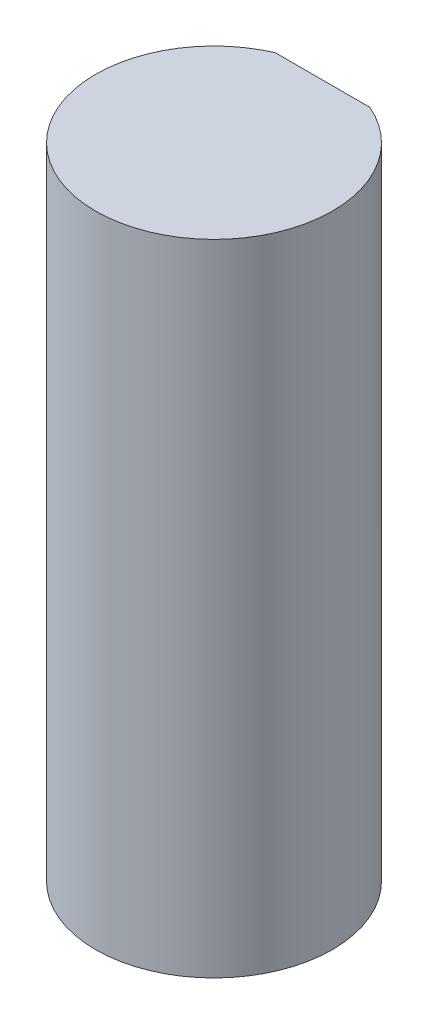
ISO-10303-21;
HEADER;
FILE_DESCRIPTION(('STEP AP214'),'2;1');
FILE_NAME('part.step','',(''),(''),'','','');
FILE_SCHEMA(('AUTOMOTIVE_DESIGN { 1 0 10303 214 1 1 1 1 }'));
ENDSEC;
DATA;
#1=APPLICATION_CONTEXT('core data for automotive mechanical design processes');
#2=APPLICATION_PROTOCOL_DEFINITION('international standard','automotive_design',2000,#1);
#3=PRODUCT_CONTEXT('',#1,'mechanical');
#4=PRODUCT('Part','Part','',(#3));
#5=PRODUCT_RELATED_PRODUCT_CATEGORY('part','',(#4));
#6=PRODUCT_DEFINITION_FORMATION('','',#4);
#7=PRODUCT_DEFINITION_CONTEXT('part definition',#1,'design');
#8=PRODUCT_DEFINITION('design','',#6,#7);
#9=PRODUCT_DEFINITION_SHAPE('','',#8);
#10=(LENGTH_UNIT() NAMED_UNIT(*) SI_UNIT(.MILLI.,.METRE.));
#11=(NAMED_UNIT(*) PLANE_ANGLE_UNIT() SI_UNIT($,.RADIAN.));
#12=(NAMED_UNIT(*) SI_UNIT($,.STERADIAN.) SOLID_ANGLE_UNIT());
#13=UNCERTAINTY_MEASURE_WITH_UNIT(LENGTH_MEASURE(1.E-05),#10,'distance_accuracy_value','');
#14=(GEOMETRIC_REPRESENTATION_CONTEXT(3) GLOBAL_UNCERTAINTY_ASSIGNED_CONTEXT((#13)) GLOBAL_UNIT_ASSIGNED_CONTEXT((#10,
#11,#12)) REPRESENTATION_CONTEXT('',''));
#15=CARTESIAN_POINT('',(0.,0.,0.));
#16=DIRECTION('',(0.,0.,1.));
#17=DIRECTION('',(1.,0.,0.));
#18=AXIS2_PLACEMENT_3D('',#15,#16,#17);
#19=CARTESIAN_POINT('',(0.,16.2,0.));
#20=DIRECTION('',(0.,-1.,0.));
#21=DIRECTION('',(0.,0.,-1.));
#22=AXIS2_PLACEMENT_3D('',#19,#20,#21);
#23=CYLINDRICAL_SURFACE('',#22,3.);
#24=CARTESIAN_POINT('',(0.,16.2,0.));
#25=DIRECTION('',(0.,1.,0.));
#26=DIRECTION('',(0.,0.,1.));
#27=AXIS2_PLACEMENT_3D('',#24,#25,#26);
#28=CIRCLE('',#27,3.);
#29=CARTESIAN_POINT('',(-1.19895788082818,16.2,-2.75));
#30=VERTEX_POINT('',#29);
#31=CARTESIAN_POINT('',(1.19895788082818,16.2,-2.75));
#32=VERTEX_POINT('',#31);
#33=EDGE_CURVE('E11',#30,#32,#28,.T.);
#34=ORIENTED_EDGE('',*,*,#33,.F.);
#35=DIRECTION('',(0.,1.,0.));
#36=VECTOR('',#35,1.);
#37=CARTESIAN_POINT('',(-1.19895788082818,4.2,-2.75));
#38=LINE('',#37,#36);
#39=CARTESIAN_POINT('',(-1.19895788082818,4.2,-2.75));
#40=VERTEX_POINT('',#39);
#41=EDGE_CURVE('E49',#40,#30,#38,.T.);
#42=ORIENTED_EDGE('',*,*,#41,.F.);
#43=CARTESIAN_POINT('',(0.,4.2,0.));
#44=DIRECTION('',(0.,1.,0.));
#45=DIRECTION('',(0.,0.,1.));
#46=AXIS2_PLACEMENT_3D('',#43,#44,#45);
#47=CIRCLE('',#46,3.);
#48=CARTESIAN_POINT('',(1.19895788082818,4.2,-2.75));
#49=VERTEX_POINT('',#48);
#50=EDGE_CURVE('E64',#49,#40,#47,.T.);
#51=ORIENTED_EDGE('',*,*,#50,.F.);
#52=DIRECTION('',(0.,1.,0.));
#53=VECTOR('',#52,1.);
#54=CARTESIAN_POINT('',(1.19895788082818,4.2,-2.75));
#55=LINE('',#54,#53);
#56=EDGE_CURVE('E55',#49,#32,#55,.T.);
#57=ORIENTED_EDGE('',*,*,#56,.T.);
#58=EDGE_LOOP('',(#34,#42,#51,#57));
#59=FACE_BOUND('',#58,.T.);
#60=CARTESIAN_POINT('',(0.,0.,0.));
#61=DIRECTION('',(0.,1.,0.));
#62=DIRECTION('',(0.,0.,1.));
#63=AXIS2_PLACEMENT_3D('',#60,#61,#62);
#64=CIRCLE('',#63,3.);
#65=CARTESIAN_POINT('',(0.,0.,3.));
#66=VERTEX_POINT('',#65);
#67=EDGE_CURVE('E38',#66,#66,#64,.T.);
#68=ORIENTED_EDGE('',*,*,#67,.T.);
#69=EDGE_LOOP('',(#68));
#70=FACE_BOUND('',#69,.T.);
#71=ADVANCED_FACE('F35',(#59,#70),#23,.T.);
#72=CARTESIAN_POINT('',(0.,16.2,0.));
#73=DIRECTION('',(0.,1.,0.));
#74=DIRECTION('',(0.,0.,1.));
#75=AXIS2_PLACEMENT_3D('',#72,#73,#74);
#76=PLANE('',#75);
#77=DIRECTION('',(1.,0.,0.));
#78=VECTOR('',#77,1.);
#79=CARTESIAN_POINT('',(-1.19895788082818,16.2,-2.75));
#80=LINE('',#79,#78);
#81=EDGE_CURVE('E60',#30,#32,#80,.T.);
#82=ORIENTED_EDGE('',*,*,#81,.F.);
#83=ORIENTED_EDGE('',*,*,#33,.T.);
#84=EDGE_LOOP('',(#82,#83));
#85=FACE_BOUND('',#84,.T.);
#86=ADVANCED_FACE('F70',(#85),#76,.T.);
#87=CARTESIAN_POINT('',(0.,0.,0.));
#88=DIRECTION('',(0.,1.,0.));
#89=DIRECTION('',(0.,0.,1.));
#90=AXIS2_PLACEMENT_3D('',#87,#88,#89);
#91=PLANE('',#90);
#92=ORIENTED_EDGE('',*,*,#67,.F.);
#93=EDGE_LOOP('',(#92));
#94=FACE_BOUND('',#93,.T.);
#95=ADVANCED_FACE('F72',(#94),#91,.F.);
#96=CARTESIAN_POINT('',(-1.19895788082818,4.2,-2.75));
#97=DIRECTION('',(0.,0.,1.));
#98=DIRECTION('',(1.,0.,0.));
#99=AXIS2_PLACEMENT_3D('',#96,#97,#98);
#100=PLANE('',#99);
#101=ORIENTED_EDGE('',*,*,#81,.T.);
#102=ORIENTED_EDGE('',*,*,#56,.F.);
#103=DIRECTION('',(1.,0.,0.));
#104=VECTOR('',#103,1.);
#105=CARTESIAN_POINT('',(-1.19895788082818,4.2,-2.75));
#106=LINE('',#105,#104);
#107=EDGE_CURVE('E87',#40,#49,#106,.T.);
#108=ORIENTED_EDGE('',*,*,#107,.F.);
#109=ORIENTED_EDGE('',*,*,#41,.T.);
#110=EDGE_LOOP('',(#101,#102,#108,#109));
#111=FACE_BOUND('',#110,.T.);
#112=ADVANCED_FACE('F61',(#111),#100,.F.);
#113=CARTESIAN_POINT('',(0.,4.2,0.));
#114=DIRECTION('',(0.,1.,0.));
#115=DIRECTION('',(0.,0.,1.));
#116=AXIS2_PLACEMENT_3D('',#113,#114,#115);
#117=PLANE('',#116);
#118=ORIENTED_EDGE('',*,*,#50,.T.);
#119=ORIENTED_EDGE('',*,*,#107,.T.);
#120=EDGE_LOOP('',(#118,#119));
#121=FACE_BOUND('',#120,.T.);
#122=ADVANCED_FACE('F82',(#121),#117,.T.);
#123=CLOSED_SHELL('',(#71,#86,#95,#112,#122));
#124=MANIFOLD_SOLID_BREP('B2',#123);
#125=ADVANCED_BREP_SHAPE_REPRESENTATION('',(#18,#124),#14);
#126=SHAPE_DEFINITION_REPRESENTATION(#9,#125);
ENDSEC;
END-ISO-10303-21;
